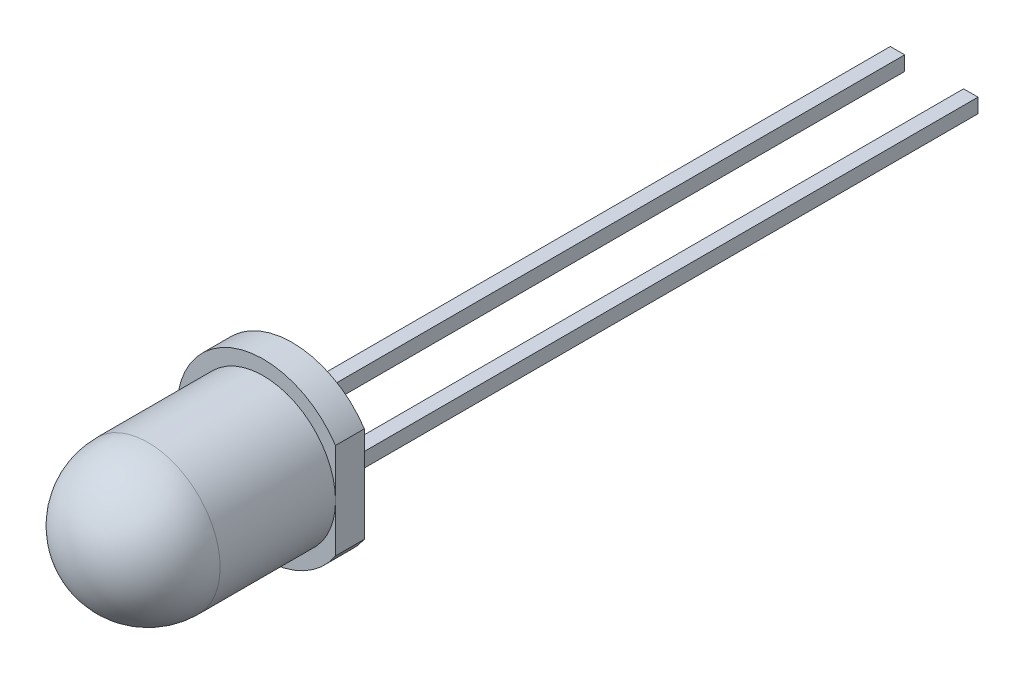
ISO-10303-21;
HEADER;
FILE_DESCRIPTION(('STEP AP214'),'2;1');
FILE_NAME('part.step','',(''),(''),'','','');
FILE_SCHEMA(('AUTOMOTIVE_DESIGN { 1 0 10303 214 1 1 1 1 }'));
ENDSEC;
DATA;
#1=APPLICATION_CONTEXT('core data for automotive mechanical design processes');
#2=APPLICATION_PROTOCOL_DEFINITION('international standard','automotive_design',2000,#1);
#3=PRODUCT_CONTEXT('',#1,'mechanical');
#4=PRODUCT('Part','Part','',(#3));
#5=PRODUCT_RELATED_PRODUCT_CATEGORY('part','',(#4));
#6=PRODUCT_DEFINITION_FORMATION('','',#4);
#7=PRODUCT_DEFINITION_CONTEXT('part definition',#1,'design');
#8=PRODUCT_DEFINITION('design','',#6,#7);
#9=PRODUCT_DEFINITION_SHAPE('','',#8);
#10=(LENGTH_UNIT() NAMED_UNIT(*) SI_UNIT(.MILLI.,.METRE.));
#11=(NAMED_UNIT(*) PLANE_ANGLE_UNIT() SI_UNIT($,.RADIAN.));
#12=(NAMED_UNIT(*) SI_UNIT($,.STERADIAN.) SOLID_ANGLE_UNIT());
#13=UNCERTAINTY_MEASURE_WITH_UNIT(LENGTH_MEASURE(1.E-05),#10,'distance_accuracy_value','');
#14=(GEOMETRIC_REPRESENTATION_CONTEXT(3) GLOBAL_UNCERTAINTY_ASSIGNED_CONTEXT((#13)) GLOBAL_UNIT_ASSIGNED_CONTEXT((#10,
#11,#12)) REPRESENTATION_CONTEXT('',''));
#15=CARTESIAN_POINT('',(0.,0.,0.));
#16=DIRECTION('',(0.,0.,1.));
#17=DIRECTION('',(1.,0.,0.));
#18=AXIS2_PLACEMENT_3D('',#15,#16,#17);
#19=CARTESIAN_POINT('',(1.77,0.25,0.));
#20=DIRECTION('',(-1.,0.,0.));
#21=DIRECTION('',(0.,-1.,0.));
#22=AXIS2_PLACEMENT_3D('',#19,#20,#21);
#23=PLANE('',#22);
#24=DIRECTION('',(0.,0.,-1.));
#25=VECTOR('',#24,1.);
#26=CARTESIAN_POINT('',(1.77,-0.25,0.));
#27=LINE('',#26,#25);
#28=CARTESIAN_POINT('',(1.77,-0.25,0.));
#29=VERTEX_POINT('',#28);
#30=CARTESIAN_POINT('',(1.77,-0.25,-22.));
#31=VERTEX_POINT('',#30);
#32=EDGE_CURVE('E114',#29,#31,#27,.T.);
#33=ORIENTED_EDGE('',*,*,#32,.T.);
#34=DIRECTION('',(0.,-1.,0.));
#35=VECTOR('',#34,1.);
#36=CARTESIAN_POINT('',(1.77,0.25,-22.));
#37=LINE('',#36,#35);
#38=CARTESIAN_POINT('',(1.77,0.25,-22.));
#39=VERTEX_POINT('',#38);
#40=EDGE_CURVE('E12',#39,#31,#37,.T.);
#41=ORIENTED_EDGE('',*,*,#40,.F.);
#42=DIRECTION('',(0.,0.,-1.));
#43=VECTOR('',#42,1.);
#44=CARTESIAN_POINT('',(1.77,0.25,0.));
#45=LINE('',#44,#43);
#46=CARTESIAN_POINT('',(1.77,0.25,0.));
#47=VERTEX_POINT('',#46);
#48=EDGE_CURVE('E91',#47,#39,#45,.T.);
#49=ORIENTED_EDGE('',*,*,#48,.F.);
#50=DIRECTION('',(0.,-1.,0.));
#51=VECTOR('',#50,1.);
#52=CARTESIAN_POINT('',(1.77,0.25,0.));
#53=LINE('',#52,#51);
#54=EDGE_CURVE('E67',#47,#29,#53,.T.);
#55=ORIENTED_EDGE('',*,*,#54,.T.);
#56=EDGE_LOOP('',(#33,#41,#49,#55));
#57=FACE_BOUND('',#56,.T.);
#58=ADVANCED_FACE('F51',(#57),#23,.F.);
#59=CARTESIAN_POINT('',(1.27,0.25,-22.));
#60=DIRECTION('',(0.,0.,-1.));
#61=DIRECTION('',(-1.,0.,0.));
#62=AXIS2_PLACEMENT_3D('',#59,#60,#61);
#63=PLANE('',#62);
#64=DIRECTION('',(1.,0.,0.));
#65=VECTOR('',#64,1.);
#66=CARTESIAN_POINT('',(1.27,-0.25,-22.));
#67=LINE('',#66,#65);
#68=CARTESIAN_POINT('',(1.27,-0.25,-22.));
#69=VERTEX_POINT('',#68);
#70=EDGE_CURVE('E100',#69,#31,#67,.T.);
#71=ORIENTED_EDGE('',*,*,#70,.F.);
#72=DIRECTION('',(0.,-1.,0.));
#73=VECTOR('',#72,1.);
#74=CARTESIAN_POINT('',(1.27,0.25,-22.));
#75=LINE('',#74,#73);
#76=CARTESIAN_POINT('',(1.27,0.25,-22.));
#77=VERTEX_POINT('',#76);
#78=EDGE_CURVE('E59',#77,#69,#75,.T.);
#79=ORIENTED_EDGE('',*,*,#78,.F.);
#80=DIRECTION('',(1.,0.,0.));
#81=VECTOR('',#80,1.);
#82=CARTESIAN_POINT('',(1.27,0.25,-22.));
#83=LINE('',#82,#81);
#84=EDGE_CURVE('E98',#77,#39,#83,.T.);
#85=ORIENTED_EDGE('',*,*,#84,.T.);
#86=ORIENTED_EDGE('',*,*,#40,.T.);
#87=EDGE_LOOP('',(#71,#79,#85,#86));
#88=FACE_BOUND('',#87,.T.);
#89=ADVANCED_FACE('F97',(#88),#63,.T.);
#90=CARTESIAN_POINT('',(1.27,0.25,0.));
#91=DIRECTION('',(-1.,0.,0.));
#92=DIRECTION('',(0.,-1.,0.));
#93=AXIS2_PLACEMENT_3D('',#90,#91,#92);
#94=PLANE('',#93);
#95=DIRECTION('',(0.,0.,-1.));
#96=VECTOR('',#95,1.);
#97=CARTESIAN_POINT('',(1.27,-0.25,0.));
#98=LINE('',#97,#96);
#99=CARTESIAN_POINT('',(1.27,-0.25,0.));
#100=VERTEX_POINT('',#99);
#101=EDGE_CURVE('E117',#100,#69,#98,.T.);
#102=ORIENTED_EDGE('',*,*,#101,.F.);
#103=DIRECTION('',(0.,-1.,0.));
#104=VECTOR('',#103,1.);
#105=CARTESIAN_POINT('',(1.27,0.25,0.));
#106=LINE('',#105,#104);
#107=CARTESIAN_POINT('',(1.27,0.25,0.));
#108=VERTEX_POINT('',#107);
#109=EDGE_CURVE('E80',#108,#100,#106,.T.);
#110=ORIENTED_EDGE('',*,*,#109,.F.);
#111=DIRECTION('',(0.,0.,-1.));
#112=VECTOR('',#111,1.);
#113=CARTESIAN_POINT('',(1.27,0.25,0.));
#114=LINE('',#113,#112);
#115=EDGE_CURVE('E106',#108,#77,#114,.T.);
#116=ORIENTED_EDGE('',*,*,#115,.T.);
#117=ORIENTED_EDGE('',*,*,#78,.T.);
#118=EDGE_LOOP('',(#102,#110,#116,#117));
#119=FACE_BOUND('',#118,.T.);
#120=ADVANCED_FACE('F108',(#119),#94,.T.);
#121=CARTESIAN_POINT('',(1.77,0.25,0.));
#122=DIRECTION('',(0.,0.,1.));
#123=DIRECTION('',(1.,0.,0.));
#124=AXIS2_PLACEMENT_3D('',#121,#122,#123);
#125=PLANE('',#124);
#126=DIRECTION('',(-1.,0.,0.));
#127=VECTOR('',#126,1.);
#128=CARTESIAN_POINT('',(1.77,-0.25,0.));
#129=LINE('',#128,#127);
#130=EDGE_CURVE('E119',#29,#100,#129,.T.);
#131=ORIENTED_EDGE('',*,*,#130,.F.);
#132=ORIENTED_EDGE('',*,*,#54,.F.);
#133=DIRECTION('',(-1.,0.,0.));
#134=VECTOR('',#133,1.);
#135=CARTESIAN_POINT('',(1.77,0.25,0.));
#136=LINE('',#135,#134);
#137=EDGE_CURVE('E109',#47,#108,#136,.T.);
#138=ORIENTED_EDGE('',*,*,#137,.T.);
#139=ORIENTED_EDGE('',*,*,#109,.T.);
#140=EDGE_LOOP('',(#131,#132,#138,#139));
#141=FACE_BOUND('',#140,.T.);
#142=ADVANCED_FACE('F125',(#141),#125,.T.);
#143=CARTESIAN_POINT('',(0.,0.25,0.));
#144=DIRECTION('',(0.,-1.,0.));
#145=DIRECTION('',(-1.,0.,0.));
#146=AXIS2_PLACEMENT_3D('',#143,#144,#145);
#147=PLANE('',#146);
#148=ORIENTED_EDGE('',*,*,#48,.T.);
#149=ORIENTED_EDGE('',*,*,#84,.F.);
#150=ORIENTED_EDGE('',*,*,#115,.F.);
#151=ORIENTED_EDGE('',*,*,#137,.F.);
#152=EDGE_LOOP('',(#148,#149,#150,#151));
#153=FACE_BOUND('',#152,.T.);
#154=ADVANCED_FACE('F105',(#153),#147,.F.);
#155=CARTESIAN_POINT('',(0.,-0.25,0.));
#156=DIRECTION('',(0.,-1.,0.));
#157=DIRECTION('',(-1.,0.,0.));
#158=AXIS2_PLACEMENT_3D('',#155,#156,#157);
#159=PLANE('',#158);
#160=ORIENTED_EDGE('',*,*,#32,.F.);
#161=ORIENTED_EDGE('',*,*,#130,.T.);
#162=ORIENTED_EDGE('',*,*,#101,.T.);
#163=ORIENTED_EDGE('',*,*,#70,.T.);
#164=EDGE_LOOP('',(#160,#161,#162,#163));
#165=FACE_BOUND('',#164,.T.);
#166=ADVANCED_FACE('F124',(#165),#159,.T.);
#167=CLOSED_SHELL('',(#58,#89,#120,#142,#154,#166));
#168=MANIFOLD_SOLID_BREP('B2',#167);
#169=CARTESIAN_POINT('',(-0.77,0.25,0.));
#170=DIRECTION('',(-1.,0.,0.));
#171=DIRECTION('',(0.,-1.,0.));
#172=AXIS2_PLACEMENT_3D('',#169,#170,#171);
#173=PLANE('',#172);
#174=DIRECTION('',(0.,0.,-1.));
#175=VECTOR('',#174,1.);
#176=CARTESIAN_POINT('',(-0.77,-0.25,0.));
#177=LINE('',#176,#175);
#178=CARTESIAN_POINT('',(-0.77,-0.25,0.));
#179=VERTEX_POINT('',#178);
#180=CARTESIAN_POINT('',(-0.77,-0.25,-22.));
#181=VERTEX_POINT('',#180);
#182=EDGE_CURVE('E260',#179,#181,#177,.T.);
#183=ORIENTED_EDGE('',*,*,#182,.T.);
#184=DIRECTION('',(0.,-1.,0.));
#185=VECTOR('',#184,1.);
#186=CARTESIAN_POINT('',(-0.77,0.25,-22.));
#187=LINE('',#186,#185);
#188=CARTESIAN_POINT('',(-0.77,0.25,-22.));
#189=VERTEX_POINT('',#188);
#190=EDGE_CURVE('E49',#189,#181,#187,.T.);
#191=ORIENTED_EDGE('',*,*,#190,.F.);
#192=DIRECTION('',(0.,0.,-1.));
#193=VECTOR('',#192,1.);
#194=CARTESIAN_POINT('',(-0.77,0.25,0.));
#195=LINE('',#194,#193);
#196=CARTESIAN_POINT('',(-0.77,0.25,0.));
#197=VERTEX_POINT('',#196);
#198=EDGE_CURVE('E237',#197,#189,#195,.T.);
#199=ORIENTED_EDGE('',*,*,#198,.F.);
#200=DIRECTION('',(0.,-1.,0.));
#201=VECTOR('',#200,1.);
#202=CARTESIAN_POINT('',(-0.77,0.25,0.));
#203=LINE('',#202,#201);
#204=EDGE_CURVE('E213',#197,#179,#203,.T.);
#205=ORIENTED_EDGE('',*,*,#204,.T.);
#206=EDGE_LOOP('',(#183,#191,#199,#205));
#207=FACE_BOUND('',#206,.T.);
#208=ADVANCED_FACE('F197',(#207),#173,.F.);
#209=CARTESIAN_POINT('',(-1.27,0.25,-22.));
#210=DIRECTION('',(0.,0.,-1.));
#211=DIRECTION('',(-1.,0.,0.));
#212=AXIS2_PLACEMENT_3D('',#209,#210,#211);
#213=PLANE('',#212);
#214=DIRECTION('',(1.,0.,0.));
#215=VECTOR('',#214,1.);
#216=CARTESIAN_POINT('',(-1.27,-0.25,-22.));
#217=LINE('',#216,#215);
#218=CARTESIAN_POINT('',(-1.27,-0.25,-22.));
#219=VERTEX_POINT('',#218);
#220=EDGE_CURVE('E246',#219,#181,#217,.T.);
#221=ORIENTED_EDGE('',*,*,#220,.F.);
#222=DIRECTION('',(0.,-1.,0.));
#223=VECTOR('',#222,1.);
#224=CARTESIAN_POINT('',(-1.27,0.25,-22.));
#225=LINE('',#224,#223);
#226=CARTESIAN_POINT('',(-1.27,0.25,-22.));
#227=VERTEX_POINT('',#226);
#228=EDGE_CURVE('E205',#227,#219,#225,.T.);
#229=ORIENTED_EDGE('',*,*,#228,.F.);
#230=DIRECTION('',(1.,0.,0.));
#231=VECTOR('',#230,1.);
#232=CARTESIAN_POINT('',(-1.27,0.25,-22.));
#233=LINE('',#232,#231);
#234=EDGE_CURVE('E244',#227,#189,#233,.T.);
#235=ORIENTED_EDGE('',*,*,#234,.T.);
#236=ORIENTED_EDGE('',*,*,#190,.T.);
#237=EDGE_LOOP('',(#221,#229,#235,#236));
#238=FACE_BOUND('',#237,.T.);
#239=ADVANCED_FACE('F243',(#238),#213,.T.);
#240=CARTESIAN_POINT('',(-1.27,0.25,0.));
#241=DIRECTION('',(-1.,0.,0.));
#242=DIRECTION('',(0.,-1.,0.));
#243=AXIS2_PLACEMENT_3D('',#240,#241,#242);
#244=PLANE('',#243);
#245=DIRECTION('',(0.,0.,-1.));
#246=VECTOR('',#245,1.);
#247=CARTESIAN_POINT('',(-1.27,-0.25,0.));
#248=LINE('',#247,#246);
#249=CARTESIAN_POINT('',(-1.27,-0.25,0.));
#250=VERTEX_POINT('',#249);
#251=EDGE_CURVE('E263',#250,#219,#248,.T.);
#252=ORIENTED_EDGE('',*,*,#251,.F.);
#253=DIRECTION('',(0.,-1.,0.));
#254=VECTOR('',#253,1.);
#255=CARTESIAN_POINT('',(-1.27,0.25,0.));
#256=LINE('',#255,#254);
#257=CARTESIAN_POINT('',(-1.27,0.25,0.));
#258=VERTEX_POINT('',#257);
#259=EDGE_CURVE('E226',#258,#250,#256,.T.);
#260=ORIENTED_EDGE('',*,*,#259,.F.);
#261=DIRECTION('',(0.,0.,-1.));
#262=VECTOR('',#261,1.);
#263=CARTESIAN_POINT('',(-1.27,0.25,0.));
#264=LINE('',#263,#262);
#265=EDGE_CURVE('E252',#258,#227,#264,.T.);
#266=ORIENTED_EDGE('',*,*,#265,.T.);
#267=ORIENTED_EDGE('',*,*,#228,.T.);
#268=EDGE_LOOP('',(#252,#260,#266,#267));
#269=FACE_BOUND('',#268,.T.);
#270=ADVANCED_FACE('F254',(#269),#244,.T.);
#271=CARTESIAN_POINT('',(-0.77,0.25,0.));
#272=DIRECTION('',(0.,0.,1.));
#273=DIRECTION('',(1.,0.,0.));
#274=AXIS2_PLACEMENT_3D('',#271,#272,#273);
#275=PLANE('',#274);
#276=DIRECTION('',(-1.,0.,0.));
#277=VECTOR('',#276,1.);
#278=CARTESIAN_POINT('',(-0.77,-0.25,0.));
#279=LINE('',#278,#277);
#280=EDGE_CURVE('E265',#179,#250,#279,.T.);
#281=ORIENTED_EDGE('',*,*,#280,.F.);
#282=ORIENTED_EDGE('',*,*,#204,.F.);
#283=DIRECTION('',(-1.,0.,0.));
#284=VECTOR('',#283,1.);
#285=CARTESIAN_POINT('',(-0.77,0.25,0.));
#286=LINE('',#285,#284);
#287=EDGE_CURVE('E255',#197,#258,#286,.T.);
#288=ORIENTED_EDGE('',*,*,#287,.T.);
#289=ORIENTED_EDGE('',*,*,#259,.T.);
#290=EDGE_LOOP('',(#281,#282,#288,#289));
#291=FACE_BOUND('',#290,.T.);
#292=ADVANCED_FACE('F271',(#291),#275,.T.);
#293=CARTESIAN_POINT('',(0.,0.25,0.));
#294=DIRECTION('',(0.,-1.,0.));
#295=DIRECTION('',(-1.,0.,0.));
#296=AXIS2_PLACEMENT_3D('',#293,#294,#295);
#297=PLANE('',#296);
#298=ORIENTED_EDGE('',*,*,#198,.T.);
#299=ORIENTED_EDGE('',*,*,#234,.F.);
#300=ORIENTED_EDGE('',*,*,#265,.F.);
#301=ORIENTED_EDGE('',*,*,#287,.F.);
#302=EDGE_LOOP('',(#298,#299,#300,#301));
#303=FACE_BOUND('',#302,.T.);
#304=ADVANCED_FACE('F251',(#303),#297,.F.);
#305=CARTESIAN_POINT('',(0.,-0.25,0.));
#306=DIRECTION('',(0.,-1.,0.));
#307=DIRECTION('',(-1.,0.,0.));
#308=AXIS2_PLACEMENT_3D('',#305,#306,#307);
#309=PLANE('',#308);
#310=ORIENTED_EDGE('',*,*,#182,.F.);
#311=ORIENTED_EDGE('',*,*,#280,.T.);
#312=ORIENTED_EDGE('',*,*,#251,.T.);
#313=ORIENTED_EDGE('',*,*,#220,.T.);
#314=EDGE_LOOP('',(#310,#311,#312,#313));
#315=FACE_BOUND('',#314,.T.);
#316=ADVANCED_FACE('F270',(#315),#309,.T.);
#317=CLOSED_SHELL('',(#208,#239,#270,#292,#304,#316));
#318=MANIFOLD_SOLID_BREP('B6',#317);
#319=CARTESIAN_POINT('',(0.,0.,1.));
#320=DIRECTION('',(0.,0.,1.));
#321=DIRECTION('',(1.,0.,0.));
#322=AXIS2_PLACEMENT_3D('',#319,#320,#321);
#323=PLANE('',#322);
#324=DIRECTION('',(0.,-1.,0.));
#325=VECTOR('',#324,1.);
#326=CARTESIAN_POINT('',(2.5,1.85027574752907,1.));
#327=LINE('',#326,#325);
#328=CARTESIAN_POINT('',(2.5,1.6583123951777,1.));
#329=VERTEX_POINT('',#328);
#330=CARTESIAN_POINT('',(2.5,0.,1.));
#331=VERTEX_POINT('',#330);
#332=EDGE_CURVE('E360',#329,#331,#327,.T.);
#333=ORIENTED_EDGE('',*,*,#332,.F.);
#334=CARTESIAN_POINT('',(0.,0.,1.));
#335=DIRECTION('',(0.,0.,1.));
#336=DIRECTION('',(1.,0.,0.));
#337=AXIS2_PLACEMENT_3D('',#334,#335,#336);
#338=CIRCLE('',#337,3.);
#339=CARTESIAN_POINT('',(2.5,-1.6583123951777,1.));
#340=VERTEX_POINT('',#339);
#341=EDGE_CURVE('E195',#329,#340,#338,.T.);
#342=ORIENTED_EDGE('',*,*,#341,.T.);
#343=EDGE_CURVE('E380',#331,#340,#327,.T.);
#344=ORIENTED_EDGE('',*,*,#343,.F.);
#345=CARTESIAN_POINT('',(0.,0.,1.));
#346=DIRECTION('',(0.,0.,1.));
#347=DIRECTION('',(1.,0.,0.));
#348=AXIS2_PLACEMENT_3D('',#345,#346,#347);
#349=CIRCLE('',#348,2.5);
#350=EDGE_CURVE('E379',#331,#331,#349,.T.);
#351=ORIENTED_EDGE('',*,*,#350,.F.);
#352=EDGE_LOOP('',(#333,#342,#344,#351));
#353=FACE_BOUND('',#352,.T.);
#354=ADVANCED_FACE('F337',(#353),#323,.T.);
#355=CARTESIAN_POINT('',(0.,0.,1.));
#356=DIRECTION('',(0.,0.,-1.));
#357=DIRECTION('',(-1.,0.,0.));
#358=AXIS2_PLACEMENT_3D('',#355,#356,#357);
#359=CYLINDRICAL_SURFACE('',#358,3.);
#360=ORIENTED_EDGE('',*,*,#341,.F.);
#361=DIRECTION('',(0.,0.,-1.));
#362=VECTOR('',#361,1.);
#363=CARTESIAN_POINT('',(2.5,1.6583123951777,1.));
#364=LINE('',#363,#362);
#365=CARTESIAN_POINT('',(2.5,1.6583123951777,0.));
#366=VERTEX_POINT('',#365);
#367=EDGE_CURVE('E368',#366,#329,#364,.F.);
#368=ORIENTED_EDGE('',*,*,#367,.F.);
#369=CARTESIAN_POINT('',(0.,0.,0.));
#370=DIRECTION('',(0.,0.,1.));
#371=DIRECTION('',(1.,0.,0.));
#372=AXIS2_PLACEMENT_3D('',#369,#370,#371);
#373=CIRCLE('',#372,3.);
#374=CARTESIAN_POINT('',(2.5,-1.6583123951777,0.));
#375=VERTEX_POINT('',#374);
#376=EDGE_CURVE('E346',#366,#375,#373,.T.);
#377=ORIENTED_EDGE('',*,*,#376,.T.);
#378=DIRECTION('',(0.,0.,-1.));
#379=VECTOR('',#378,1.);
#380=CARTESIAN_POINT('',(2.5,-1.6583123951777,1.));
#381=LINE('',#380,#379);
#382=EDGE_CURVE('E354',#340,#375,#381,.T.);
#383=ORIENTED_EDGE('',*,*,#382,.F.);
#384=EDGE_LOOP('',(#360,#368,#377,#383));
#385=FACE_BOUND('',#384,.T.);
#386=ADVANCED_FACE('F382',(#385),#359,.T.);
#387=CARTESIAN_POINT('',(0.,0.,0.));
#388=DIRECTION('',(0.,0.,1.));
#389=DIRECTION('',(1.,0.,0.));
#390=AXIS2_PLACEMENT_3D('',#387,#388,#389);
#391=PLANE('',#390);
#392=ORIENTED_EDGE('',*,*,#376,.F.);
#393=DIRECTION('',(0.,1.,0.));
#394=VECTOR('',#393,1.);
#395=CARTESIAN_POINT('',(2.5,1.85027574752907,0.));
#396=LINE('',#395,#394);
#397=EDGE_CURVE('E370',#375,#366,#396,.T.);
#398=ORIENTED_EDGE('',*,*,#397,.F.);
#399=EDGE_LOOP('',(#392,#398));
#400=FACE_BOUND('',#399,.T.);
#401=ADVANCED_FACE('F393',(#400),#391,.F.);
#402=CARTESIAN_POINT('',(0.,0.,5.));
#403=DIRECTION('',(0.,0.,-1.));
#404=DIRECTION('',(-1.,0.,0.));
#405=AXIS2_PLACEMENT_3D('',#402,#403,#404);
#406=CYLINDRICAL_SURFACE('',#405,2.5);
#407=CARTESIAN_POINT('',(0.,0.,5.));
#408=DIRECTION('',(0.,0.,1.));
#409=DIRECTION('',(1.,0.,0.));
#410=AXIS2_PLACEMENT_3D('',#407,#408,#409);
#411=CIRCLE('',#410,2.5);
#412=CARTESIAN_POINT('',(2.5,0.,5.));
#413=VERTEX_POINT('',#412);
#414=EDGE_CURVE('E341',#413,#413,#411,.T.);
#415=ORIENTED_EDGE('',*,*,#414,.F.);
#416=EDGE_LOOP('',(#415));
#417=FACE_BOUND('',#416,.T.);
#418=ORIENTED_EDGE('',*,*,#350,.T.);
#419=EDGE_LOOP('',(#418));
#420=FACE_BOUND('',#419,.T.);
#421=ADVANCED_FACE('F390',(#417,#420),#406,.T.);
#422=CARTESIAN_POINT('',(0.,0.,5.));
#423=DIRECTION('',(0.,0.,1.));
#424=DIRECTION('',(1.,0.,0.));
#425=AXIS2_PLACEMENT_3D('',#422,#423,#424);
#426=SPHERICAL_SURFACE('',#425,2.5);
#427=ORIENTED_EDGE('',*,*,#414,.T.);
#428=EDGE_LOOP('',(#427));
#429=FACE_BOUND('',#428,.T.);
#430=ADVANCED_FACE('F339',(#429),#426,.T.);
#431=CARTESIAN_POINT('',(2.5,1.85027574752907,-0.000999999999999916));
#432=DIRECTION('',(-1.,0.,0.));
#433=DIRECTION('',(0.,-1.,0.));
#434=AXIS2_PLACEMENT_3D('',#431,#432,#433);
#435=PLANE('',#434);
#436=ORIENTED_EDGE('',*,*,#367,.T.);
#437=ORIENTED_EDGE('',*,*,#332,.T.);
#438=ORIENTED_EDGE('',*,*,#343,.T.);
#439=ORIENTED_EDGE('',*,*,#382,.T.);
#440=ORIENTED_EDGE('',*,*,#397,.T.);
#441=EDGE_LOOP('',(#436,#437,#438,#439,#440));
#442=FACE_BOUND('',#441,.T.);
#443=ADVANCED_FACE('F369',(#442),#435,.F.);
#444=CLOSED_SHELL('',(#354,#386,#401,#421,#430,#443));
#445=MANIFOLD_SOLID_BREP('B43',#444);
#446=ADVANCED_BREP_SHAPE_REPRESENTATION('',(#18,#168,#318,#445),#14);
#447=SHAPE_DEFINITION_REPRESENTATION(#9,#446);
ENDSEC;
END-ISO-10303-21;
